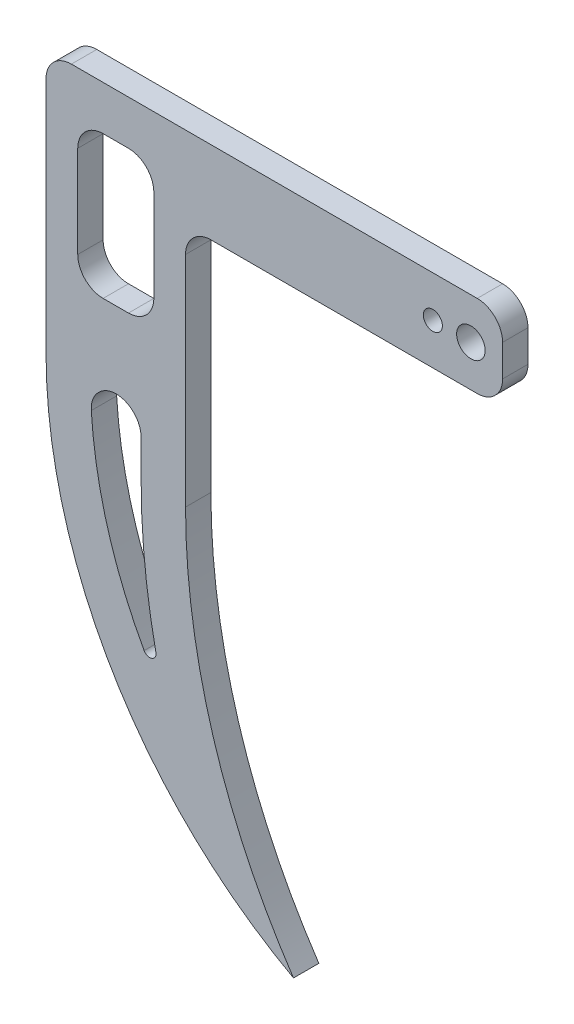
ISO-10303-21;
HEADER;
FILE_DESCRIPTION(('STEP AP214'),'2;1');
FILE_NAME('part.step','',(''),(''),'','','');
FILE_SCHEMA(('AUTOMOTIVE_DESIGN { 1 0 10303 214 1 1 1 1 }'));
ENDSEC;
DATA;
#1=APPLICATION_CONTEXT('core data for automotive mechanical design processes');
#2=APPLICATION_PROTOCOL_DEFINITION('international standard','automotive_design',2000,#1);
#3=PRODUCT_CONTEXT('',#1,'mechanical');
#4=PRODUCT('Part','Part','',(#3));
#5=PRODUCT_RELATED_PRODUCT_CATEGORY('part','',(#4));
#6=PRODUCT_DEFINITION_FORMATION('','',#4);
#7=PRODUCT_DEFINITION_CONTEXT('part definition',#1,'design');
#8=PRODUCT_DEFINITION('design','',#6,#7);
#9=PRODUCT_DEFINITION_SHAPE('','',#8);
#10=(LENGTH_UNIT() NAMED_UNIT(*) SI_UNIT(.MILLI.,.METRE.));
#11=(NAMED_UNIT(*) PLANE_ANGLE_UNIT() SI_UNIT($,.RADIAN.));
#12=(NAMED_UNIT(*) SI_UNIT($,.STERADIAN.) SOLID_ANGLE_UNIT());
#13=UNCERTAINTY_MEASURE_WITH_UNIT(LENGTH_MEASURE(1.E-05),#10,'distance_accuracy_value','');
#14=(GEOMETRIC_REPRESENTATION_CONTEXT(3) GLOBAL_UNCERTAINTY_ASSIGNED_CONTEXT((#13)) GLOBAL_UNIT_ASSIGNED_CONTEXT((#10,
#11,#12)) REPRESENTATION_CONTEXT('',''));
#15=CARTESIAN_POINT('',(0.,0.,0.));
#16=DIRECTION('',(0.,0.,1.));
#17=DIRECTION('',(1.,0.,0.));
#18=AXIS2_PLACEMENT_3D('',#15,#16,#17);
#19=CARTESIAN_POINT('',(64.,-23.25,4.));
#20=DIRECTION('',(0.,0.,1.));
#21=DIRECTION('',(1.,0.,0.));
#22=AXIS2_PLACEMENT_3D('',#19,#20,#21);
#23=PLANE('',#22);
#24=CARTESIAN_POINT('',(50.,11.75,4.));
#25=DIRECTION('',(0.,0.,1.));
#26=DIRECTION('',(1.,0.,0.));
#27=AXIS2_PLACEMENT_3D('',#24,#25,#26);
#28=CIRCLE('',#27,1.5);
#29=CARTESIAN_POINT('',(51.5,11.75,4.));
#30=VERTEX_POINT('',#29);
#31=EDGE_CURVE('E381',#30,#30,#28,.T.);
#32=ORIENTED_EDGE('',*,*,#31,.F.);
#33=EDGE_LOOP('',(#32));
#34=FACE_BOUND('',#33,.T.);
#35=CARTESIAN_POINT('',(56.,11.75,4.));
#36=DIRECTION('',(0.,0.,1.));
#37=DIRECTION('',(1.,0.,0.));
#38=AXIS2_PLACEMENT_3D('',#35,#36,#37);
#39=CIRCLE('',#38,2.25);
#40=CARTESIAN_POINT('',(58.25,11.75,4.));
#41=VERTEX_POINT('',#40);
#42=EDGE_CURVE('E535',#41,#41,#39,.T.);
#43=ORIENTED_EDGE('',*,*,#42,.F.);
#44=EDGE_LOOP('',(#43));
#45=FACE_BOUND('',#44,.T.);
#46=DIRECTION('',(0.,1.,0.));
#47=VECTOR('',#46,1.);
#48=CARTESIAN_POINT('',(4.,-23.25,4.));
#49=LINE('',#48,#47);
#50=CARTESIAN_POINT('',(4.,-33.25,4.));
#51=VERTEX_POINT('',#50);
#52=CARTESIAN_POINT('',(4.,-27.25,4.));
#53=VERTEX_POINT('',#52);
#54=EDGE_CURVE('E233',#51,#53,#49,.T.);
#55=ORIENTED_EDGE('',*,*,#54,.F.);
#56=CARTESIAN_POINT('',(111.,-33.25,4.));
#57=DIRECTION('',(0.,0.,-1.));
#58=DIRECTION('',(1.,0.,0.));
#59=AXIS2_PLACEMENT_3D('',#56,#57,#58);
#60=CIRCLE('',#59,107.);
#61=CARTESIAN_POINT('',(6.32276142221805,-55.4237620563159,4.));
#62=VERTEX_POINT('',#61);
#63=EDGE_CURVE('E215',#62,#51,#60,.T.);
#64=ORIENTED_EDGE('',*,*,#63,.F.);
#65=CARTESIAN_POINT('',(5.34446947289298,-55.630993477403,4.));
#66=DIRECTION('',(0.,0.,1.));
#67=DIRECTION('',(1.,0.,0.));
#68=AXIS2_PLACEMENT_3D('',#65,#66,#67);
#69=CIRCLE('',#68,1.);
#70=CARTESIAN_POINT('',(4.46901379338393,-56.1142918875135,4.));
#71=VERTEX_POINT('',#70);
#72=EDGE_CURVE('E41',#62,#71,#69,.F.);
#73=ORIENTED_EDGE('',*,*,#72,.T.);
#74=CARTESIAN_POINT('',(64.,-23.25,4.));
#75=DIRECTION('',(0.,0.,1.));
#76=DIRECTION('',(1.,0.,0.));
#77=AXIS2_PLACEMENT_3D('',#74,#75,#76);
#78=CIRCLE('',#77,68.);
#79=CARTESIAN_POINT('',(-3.86705754635307,-27.5,4.));
#80=VERTEX_POINT('',#79);
#81=EDGE_CURVE('E227',#80,#71,#78,.T.);
#82=ORIENTED_EDGE('',*,*,#81,.F.);
#83=CARTESIAN_POINT('',(0.125122309314774,-27.25,4.));
#84=DIRECTION('',(0.,0.,1.));
#85=DIRECTION('',(1.,0.,0.));
#86=AXIS2_PLACEMENT_3D('',#83,#84,#85);
#87=CIRCLE('',#86,4.);
#88=CARTESIAN_POINT('',(0.0625611546573881,-23.2504892671818,4.));
#89=VERTEX_POINT('',#88);
#90=EDGE_CURVE('E357',#80,#89,#87,.F.);
#91=ORIENTED_EDGE('',*,*,#90,.T.);
#92=CARTESIAN_POINT('',(0.,-27.25,4.));
#93=DIRECTION('',(0.,0.,1.));
#94=DIRECTION('',(1.,0.,0.));
#95=AXIS2_PLACEMENT_3D('',#92,#93,#94);
#96=CIRCLE('',#95,4.);
#97=EDGE_CURVE('E353',#89,#53,#96,.F.);
#98=ORIENTED_EDGE('',*,*,#97,.T.);
#99=EDGE_LOOP('',(#55,#64,#73,#82,#91,#98));
#100=FACE_BOUND('',#99,.T.);
#101=DIRECTION('',(-1.,0.,0.));
#102=VECTOR('',#101,1.);
#103=CARTESIAN_POINT('',(-11.,18.25,4.));
#104=LINE('',#103,#102);
#105=CARTESIAN_POINT('',(57.,18.25,4.));
#106=VERTEX_POINT('',#105);
#107=CARTESIAN_POINT('',(-7.00000000000001,18.25,4.));
#108=VERTEX_POINT('',#107);
#109=EDGE_CURVE('E264',#106,#108,#104,.T.);
#110=ORIENTED_EDGE('',*,*,#109,.T.);
#111=CARTESIAN_POINT('',(-7.00000000000001,14.25,4.));
#112=DIRECTION('',(0.,0.,1.));
#113=DIRECTION('',(1.,0.,0.));
#114=AXIS2_PLACEMENT_3D('',#111,#112,#113);
#115=CIRCLE('',#114,4.);
#116=CARTESIAN_POINT('',(-11.,14.25,4.));
#117=VERTEX_POINT('',#116);
#118=EDGE_CURVE('E319',#108,#117,#115,.T.);
#119=ORIENTED_EDGE('',*,*,#118,.T.);
#120=DIRECTION('',(0.,-1.,0.));
#121=VECTOR('',#120,1.);
#122=CARTESIAN_POINT('',(-11.,-18.25,4.));
#123=LINE('',#122,#121);
#124=CARTESIAN_POINT('',(-11.,-23.25,4.));
#125=VERTEX_POINT('',#124);
#126=EDGE_CURVE('E268',#117,#125,#123,.T.);
#127=ORIENTED_EDGE('',*,*,#126,.T.);
#128=CARTESIAN_POINT('',(64.,-23.25,4.));
#129=DIRECTION('',(0.,0.,1.));
#130=DIRECTION('',(1.,0.,0.));
#131=AXIS2_PLACEMENT_3D('',#128,#129,#130);
#132=CIRCLE('',#131,75.);
#133=CARTESIAN_POINT('',(28.0199855706445,-89.0560678179708,4.));
#134=VERTEX_POINT('',#133);
#135=EDGE_CURVE('E270',#125,#134,#132,.T.);
#136=ORIENTED_EDGE('',*,*,#135,.T.);
#137=CARTESIAN_POINT('',(111.,-33.25,4.));
#138=DIRECTION('',(0.,0.,-1.));
#139=DIRECTION('',(1.,0.,0.));
#140=AXIS2_PLACEMENT_3D('',#137,#138,#139);
#141=CIRCLE('',#140,100.);
#142=CARTESIAN_POINT('',(11.,-33.25,4.));
#143=VERTEX_POINT('',#142);
#144=EDGE_CURVE('E272',#134,#143,#141,.T.);
#145=ORIENTED_EDGE('',*,*,#144,.T.);
#146=DIRECTION('',(0.,1.,0.));
#147=VECTOR('',#146,1.);
#148=CARTESIAN_POINT('',(11.,-18.25,4.));
#149=LINE('',#148,#147);
#150=CARTESIAN_POINT('',(11.,1.25,4.));
#151=VERTEX_POINT('',#150);
#152=EDGE_CURVE('E261',#143,#151,#149,.T.);
#153=ORIENTED_EDGE('',*,*,#152,.T.);
#154=CARTESIAN_POINT('',(15.,1.25,4.));
#155=DIRECTION('',(0.,0.,1.));
#156=DIRECTION('',(1.,0.,0.));
#157=AXIS2_PLACEMENT_3D('',#154,#155,#156);
#158=CIRCLE('',#157,4.);
#159=CARTESIAN_POINT('',(15.,5.25,4.));
#160=VERTEX_POINT('',#159);
#161=EDGE_CURVE('E349',#151,#160,#158,.F.);
#162=ORIENTED_EDGE('',*,*,#161,.T.);
#163=DIRECTION('',(1.,0.,0.));
#164=VECTOR('',#163,1.);
#165=CARTESIAN_POINT('',(61.,5.25000000000001,4.));
#166=LINE('',#165,#164);
#167=CARTESIAN_POINT('',(57.,5.25000000000001,4.));
#168=VERTEX_POINT('',#167);
#169=EDGE_CURVE('E543',#160,#168,#166,.T.);
#170=ORIENTED_EDGE('',*,*,#169,.T.);
#171=CARTESIAN_POINT('',(57.,9.25000000000001,4.));
#172=DIRECTION('',(0.,0.,1.));
#173=DIRECTION('',(1.,0.,0.));
#174=AXIS2_PLACEMENT_3D('',#171,#172,#173);
#175=CIRCLE('',#174,4.);
#176=CARTESIAN_POINT('',(61.,9.25000000000001,4.));
#177=VERTEX_POINT('',#176);
#178=EDGE_CURVE('E317',#168,#177,#175,.T.);
#179=ORIENTED_EDGE('',*,*,#178,.T.);
#180=DIRECTION('',(0.,1.,0.));
#181=VECTOR('',#180,1.);
#182=CARTESIAN_POINT('',(61.,18.25,4.));
#183=LINE('',#182,#181);
#184=CARTESIAN_POINT('',(61.,14.25,4.));
#185=VERTEX_POINT('',#184);
#186=EDGE_CURVE('E230',#177,#185,#183,.T.);
#187=ORIENTED_EDGE('',*,*,#186,.T.);
#188=CARTESIAN_POINT('',(57.,14.25,4.));
#189=DIRECTION('',(0.,0.,1.));
#190=DIRECTION('',(1.,0.,0.));
#191=AXIS2_PLACEMENT_3D('',#188,#189,#190);
#192=CIRCLE('',#191,4.);
#193=EDGE_CURVE('E315',#185,#106,#192,.T.);
#194=ORIENTED_EDGE('',*,*,#193,.T.);
#195=EDGE_LOOP('',(#110,#119,#127,#136,#145,#153,#162,#170,#179,#187,#194));
#196=FACE_BOUND('',#195,.T.);
#197=DIRECTION('',(-1.,0.,0.));
#198=VECTOR('',#197,1.);
#199=CARTESIAN_POINT('',(-6.,11.25,4.));
#200=LINE('',#199,#198);
#201=CARTESIAN_POINT('',(2.,11.25,4.));
#202=VERTEX_POINT('',#201);
#203=CARTESIAN_POINT('',(-2.,11.25,4.));
#204=VERTEX_POINT('',#203);
#205=EDGE_CURVE('E240',#202,#204,#200,.T.);
#206=ORIENTED_EDGE('',*,*,#205,.F.);
#207=CARTESIAN_POINT('',(2.,7.25,4.));
#208=DIRECTION('',(0.,0.,1.));
#209=DIRECTION('',(1.,0.,0.));
#210=AXIS2_PLACEMENT_3D('',#207,#208,#209);
#211=CIRCLE('',#210,4.);
#212=CARTESIAN_POINT('',(6.,7.24999999999999,4.));
#213=VERTEX_POINT('',#212);
#214=EDGE_CURVE('E371',#202,#213,#211,.F.);
#215=ORIENTED_EDGE('',*,*,#214,.T.);
#216=DIRECTION('',(0.,1.,0.));
#217=VECTOR('',#216,1.);
#218=CARTESIAN_POINT('',(6.,-11.25,4.));
#219=LINE('',#218,#217);
#220=CARTESIAN_POINT('',(6.,-7.25,4.));
#221=VERTEX_POINT('',#220);
#222=EDGE_CURVE('E237',#221,#213,#219,.T.);
#223=ORIENTED_EDGE('',*,*,#222,.F.);
#224=CARTESIAN_POINT('',(2.,-7.25,4.));
#225=DIRECTION('',(0.,0.,1.));
#226=DIRECTION('',(1.,0.,0.));
#227=AXIS2_PLACEMENT_3D('',#224,#225,#226);
#228=CIRCLE('',#227,4.);
#229=CARTESIAN_POINT('',(2.,-11.25,4.));
#230=VERTEX_POINT('',#229);
#231=EDGE_CURVE('E363',#221,#230,#228,.F.);
#232=ORIENTED_EDGE('',*,*,#231,.T.);
#233=DIRECTION('',(1.,0.,0.));
#234=VECTOR('',#233,1.);
#235=CARTESIAN_POINT('',(-6.,-11.25,4.));
#236=LINE('',#235,#234);
#237=CARTESIAN_POINT('',(-2.,-11.25,4.));
#238=VERTEX_POINT('',#237);
#239=EDGE_CURVE('E247',#238,#230,#236,.T.);
#240=ORIENTED_EDGE('',*,*,#239,.F.);
#241=CARTESIAN_POINT('',(-2.,-7.25,4.));
#242=DIRECTION('',(0.,0.,1.));
#243=DIRECTION('',(1.,0.,0.));
#244=AXIS2_PLACEMENT_3D('',#241,#242,#243);
#245=CIRCLE('',#244,4.);
#246=CARTESIAN_POINT('',(-6.,-7.25,4.));
#247=VERTEX_POINT('',#246);
#248=EDGE_CURVE('E367',#238,#247,#245,.F.);
#249=ORIENTED_EDGE('',*,*,#248,.T.);
#250=DIRECTION('',(0.,-1.,0.));
#251=VECTOR('',#250,1.);
#252=CARTESIAN_POINT('',(-6.,-11.25,4.));
#253=LINE('',#252,#251);
#254=CARTESIAN_POINT('',(-6.,7.24999999999999,4.));
#255=VERTEX_POINT('',#254);
#256=EDGE_CURVE('E244',#255,#247,#253,.T.);
#257=ORIENTED_EDGE('',*,*,#256,.F.);
#258=CARTESIAN_POINT('',(-2.,7.25,4.));
#259=DIRECTION('',(0.,0.,1.));
#260=DIRECTION('',(1.,0.,0.));
#261=AXIS2_PLACEMENT_3D('',#258,#259,#260);
#262=CIRCLE('',#261,4.);
#263=EDGE_CURVE('E375',#255,#204,#262,.F.);
#264=ORIENTED_EDGE('',*,*,#263,.T.);
#265=EDGE_LOOP('',(#206,#215,#223,#232,#240,#249,#257,#264));
#266=FACE_BOUND('',#265,.T.);
#267=ADVANCED_FACE('F33',(#34,#45,#100,#196,#266),#23,.T.);
#268=CARTESIAN_POINT('',(64.,-23.25,0.));
#269=DIRECTION('',(0.,0.,1.));
#270=DIRECTION('',(1.,0.,0.));
#271=AXIS2_PLACEMENT_3D('',#268,#269,#270);
#272=PLANE('',#271);
#273=CARTESIAN_POINT('',(50.,11.75,0.));
#274=DIRECTION('',(0.,0.,1.));
#275=DIRECTION('',(1.,0.,0.));
#276=AXIS2_PLACEMENT_3D('',#273,#274,#275);
#277=CIRCLE('',#276,1.5);
#278=CARTESIAN_POINT('',(51.5,11.75,0.));
#279=VERTEX_POINT('',#278);
#280=EDGE_CURVE('E532',#279,#279,#277,.F.);
#281=ORIENTED_EDGE('',*,*,#280,.F.);
#282=EDGE_LOOP('',(#281));
#283=FACE_BOUND('',#282,.T.);
#284=CARTESIAN_POINT('',(56.,11.75,0.));
#285=DIRECTION('',(0.,0.,1.));
#286=DIRECTION('',(1.,0.,0.));
#287=AXIS2_PLACEMENT_3D('',#284,#285,#286);
#288=CIRCLE('',#287,2.25);
#289=CARTESIAN_POINT('',(58.25,11.75,0.));
#290=VERTEX_POINT('',#289);
#291=EDGE_CURVE('E540',#290,#290,#288,.F.);
#292=ORIENTED_EDGE('',*,*,#291,.F.);
#293=EDGE_LOOP('',(#292));
#294=FACE_BOUND('',#293,.T.);
#295=CARTESIAN_POINT('',(64.,-23.25,0.));
#296=DIRECTION('',(0.,0.,1.));
#297=DIRECTION('',(1.,0.,0.));
#298=AXIS2_PLACEMENT_3D('',#295,#296,#297);
#299=CIRCLE('',#298,68.);
#300=CARTESIAN_POINT('',(-3.86705754635307,-27.5,0.));
#301=VERTEX_POINT('',#300);
#302=CARTESIAN_POINT('',(4.46901379338393,-56.1142918875135,0.));
#303=VERTEX_POINT('',#302);
#304=EDGE_CURVE('E211',#301,#303,#299,.T.);
#305=ORIENTED_EDGE('',*,*,#304,.T.);
#306=CARTESIAN_POINT('',(5.34446947289298,-55.630993477403,0.));
#307=DIRECTION('',(0.,0.,1.));
#308=DIRECTION('',(1.,0.,0.));
#309=AXIS2_PLACEMENT_3D('',#306,#307,#308);
#310=CIRCLE('',#309,1.);
#311=CARTESIAN_POINT('',(6.32276142221805,-55.4237620563159,0.));
#312=VERTEX_POINT('',#311);
#313=EDGE_CURVE('E11',#303,#312,#310,.T.);
#314=ORIENTED_EDGE('',*,*,#313,.T.);
#315=CARTESIAN_POINT('',(111.,-33.25,0.));
#316=DIRECTION('',(0.,0.,-1.));
#317=DIRECTION('',(1.,0.,0.));
#318=AXIS2_PLACEMENT_3D('',#315,#316,#317);
#319=CIRCLE('',#318,107.);
#320=CARTESIAN_POINT('',(4.,-33.25,0.));
#321=VERTEX_POINT('',#320);
#322=EDGE_CURVE('E200',#312,#321,#319,.T.);
#323=ORIENTED_EDGE('',*,*,#322,.T.);
#324=DIRECTION('',(0.,1.,0.));
#325=VECTOR('',#324,1.);
#326=CARTESIAN_POINT('',(4.,-23.25,0.));
#327=LINE('',#326,#325);
#328=CARTESIAN_POINT('',(4.,-27.25,0.));
#329=VERTEX_POINT('',#328);
#330=EDGE_CURVE('E205',#321,#329,#327,.T.);
#331=ORIENTED_EDGE('',*,*,#330,.T.);
#332=CARTESIAN_POINT('',(0.,-27.25,0.));
#333=DIRECTION('',(0.,0.,1.));
#334=DIRECTION('',(1.,0.,0.));
#335=AXIS2_PLACEMENT_3D('',#332,#333,#334);
#336=CIRCLE('',#335,4.);
#337=CARTESIAN_POINT('',(0.0625611546573881,-23.2504892671818,0.));
#338=VERTEX_POINT('',#337);
#339=EDGE_CURVE('E355',#329,#338,#336,.T.);
#340=ORIENTED_EDGE('',*,*,#339,.T.);
#341=CARTESIAN_POINT('',(0.125122309314774,-27.25,0.));
#342=DIRECTION('',(0.,0.,1.));
#343=DIRECTION('',(1.,0.,0.));
#344=AXIS2_PLACEMENT_3D('',#341,#342,#343);
#345=CIRCLE('',#344,4.);
#346=EDGE_CURVE('E359',#338,#301,#345,.T.);
#347=ORIENTED_EDGE('',*,*,#346,.T.);
#348=EDGE_LOOP('',(#305,#314,#323,#331,#340,#347));
#349=FACE_BOUND('',#348,.T.);
#350=DIRECTION('',(0.,-1.,0.));
#351=VECTOR('',#350,1.);
#352=CARTESIAN_POINT('',(-11.,-18.25,0.));
#353=LINE('',#352,#351);
#354=CARTESIAN_POINT('',(-11.,14.25,0.));
#355=VERTEX_POINT('',#354);
#356=CARTESIAN_POINT('',(-11.,-23.25,0.));
#357=VERTEX_POINT('',#356);
#358=EDGE_CURVE('E278',#355,#357,#353,.T.);
#359=ORIENTED_EDGE('',*,*,#358,.F.);
#360=CARTESIAN_POINT('',(-7.00000000000001,14.25,0.));
#361=DIRECTION('',(0.,0.,1.));
#362=DIRECTION('',(1.,0.,0.));
#363=AXIS2_PLACEMENT_3D('',#360,#361,#362);
#364=CIRCLE('',#363,4.);
#365=CARTESIAN_POINT('',(-7.00000000000001,18.25,0.));
#366=VERTEX_POINT('',#365);
#367=EDGE_CURVE('E309',#355,#366,#364,.F.);
#368=ORIENTED_EDGE('',*,*,#367,.T.);
#369=DIRECTION('',(-1.,0.,0.));
#370=VECTOR('',#369,1.);
#371=CARTESIAN_POINT('',(-11.,18.25,0.));
#372=LINE('',#371,#370);
#373=CARTESIAN_POINT('',(57.,18.25,0.));
#374=VERTEX_POINT('',#373);
#375=EDGE_CURVE('E250',#374,#366,#372,.T.);
#376=ORIENTED_EDGE('',*,*,#375,.F.);
#377=CARTESIAN_POINT('',(57.,14.25,0.));
#378=DIRECTION('',(0.,0.,1.));
#379=DIRECTION('',(1.,0.,0.));
#380=AXIS2_PLACEMENT_3D('',#377,#378,#379);
#381=CIRCLE('',#380,4.);
#382=CARTESIAN_POINT('',(61.,14.25,0.));
#383=VERTEX_POINT('',#382);
#384=EDGE_CURVE('E305',#374,#383,#381,.F.);
#385=ORIENTED_EDGE('',*,*,#384,.T.);
#386=DIRECTION('',(0.,1.,0.));
#387=VECTOR('',#386,1.);
#388=CARTESIAN_POINT('',(61.,18.25,0.));
#389=LINE('',#388,#387);
#390=CARTESIAN_POINT('',(61.,9.25000000000001,0.));
#391=VERTEX_POINT('',#390);
#392=EDGE_CURVE('E235',#391,#383,#389,.T.);
#393=ORIENTED_EDGE('',*,*,#392,.F.);
#394=CARTESIAN_POINT('',(57.,9.25000000000001,0.));
#395=DIRECTION('',(0.,0.,1.));
#396=DIRECTION('',(1.,0.,0.));
#397=AXIS2_PLACEMENT_3D('',#394,#395,#396);
#398=CIRCLE('',#397,4.);
#399=CARTESIAN_POINT('',(57.,5.25000000000001,0.));
#400=VERTEX_POINT('',#399);
#401=EDGE_CURVE('E307',#391,#400,#398,.F.);
#402=ORIENTED_EDGE('',*,*,#401,.T.);
#403=DIRECTION('',(1.,0.,0.));
#404=VECTOR('',#403,1.);
#405=CARTESIAN_POINT('',(61.,5.25000000000001,0.));
#406=LINE('',#405,#404);
#407=CARTESIAN_POINT('',(15.,5.25,0.));
#408=VERTEX_POINT('',#407);
#409=EDGE_CURVE('E544',#408,#400,#406,.T.);
#410=ORIENTED_EDGE('',*,*,#409,.F.);
#411=CARTESIAN_POINT('',(15.,1.25,0.));
#412=DIRECTION('',(0.,0.,1.));
#413=DIRECTION('',(1.,0.,0.));
#414=AXIS2_PLACEMENT_3D('',#411,#412,#413);
#415=CIRCLE('',#414,4.);
#416=CARTESIAN_POINT('',(11.,1.25,0.));
#417=VERTEX_POINT('',#416);
#418=EDGE_CURVE('E351',#408,#417,#415,.T.);
#419=ORIENTED_EDGE('',*,*,#418,.T.);
#420=DIRECTION('',(0.,1.,0.));
#421=VECTOR('',#420,1.);
#422=CARTESIAN_POINT('',(11.,-18.25,0.));
#423=LINE('',#422,#421);
#424=CARTESIAN_POINT('',(11.,-33.25,0.));
#425=VERTEX_POINT('',#424);
#426=EDGE_CURVE('E265',#425,#417,#423,.T.);
#427=ORIENTED_EDGE('',*,*,#426,.F.);
#428=CARTESIAN_POINT('',(111.,-33.25,0.));
#429=DIRECTION('',(0.,0.,-1.));
#430=DIRECTION('',(1.,0.,0.));
#431=AXIS2_PLACEMENT_3D('',#428,#429,#430);
#432=CIRCLE('',#431,100.);
#433=CARTESIAN_POINT('',(28.0199855706445,-89.0560678179708,0.));
#434=VERTEX_POINT('',#433);
#435=EDGE_CURVE('E282',#434,#425,#432,.T.);
#436=ORIENTED_EDGE('',*,*,#435,.F.);
#437=CARTESIAN_POINT('',(64.,-23.25,0.));
#438=DIRECTION('',(0.,0.,1.));
#439=DIRECTION('',(1.,0.,0.));
#440=AXIS2_PLACEMENT_3D('',#437,#438,#439);
#441=CIRCLE('',#440,75.);
#442=EDGE_CURVE('E280',#357,#434,#441,.T.);
#443=ORIENTED_EDGE('',*,*,#442,.F.);
#444=EDGE_LOOP('',(#359,#368,#376,#385,#393,#402,#410,#419,#427,#436,#443));
#445=FACE_BOUND('',#444,.T.);
#446=DIRECTION('',(1.,0.,0.));
#447=VECTOR('',#446,1.);
#448=CARTESIAN_POINT('',(-6.,-11.25,0.));
#449=LINE('',#448,#447);
#450=CARTESIAN_POINT('',(-2.,-11.25,0.));
#451=VERTEX_POINT('',#450);
#452=CARTESIAN_POINT('',(2.,-11.25,0.));
#453=VERTEX_POINT('',#452);
#454=EDGE_CURVE('E241',#451,#453,#449,.T.);
#455=ORIENTED_EDGE('',*,*,#454,.T.);
#456=CARTESIAN_POINT('',(2.,-7.25,0.));
#457=DIRECTION('',(0.,0.,1.));
#458=DIRECTION('',(1.,0.,0.));
#459=AXIS2_PLACEMENT_3D('',#456,#457,#458);
#460=CIRCLE('',#459,4.);
#461=CARTESIAN_POINT('',(6.,-7.25,0.));
#462=VERTEX_POINT('',#461);
#463=EDGE_CURVE('E361',#453,#462,#460,.T.);
#464=ORIENTED_EDGE('',*,*,#463,.T.);
#465=DIRECTION('',(0.,1.,0.));
#466=VECTOR('',#465,1.);
#467=CARTESIAN_POINT('',(6.,-11.25,0.));
#468=LINE('',#467,#466);
#469=CARTESIAN_POINT('',(6.,7.24999999999999,0.));
#470=VERTEX_POINT('',#469);
#471=EDGE_CURVE('E219',#462,#470,#468,.T.);
#472=ORIENTED_EDGE('',*,*,#471,.T.);
#473=CARTESIAN_POINT('',(2.,7.25,0.));
#474=DIRECTION('',(0.,0.,1.));
#475=DIRECTION('',(1.,0.,0.));
#476=AXIS2_PLACEMENT_3D('',#473,#474,#475);
#477=CIRCLE('',#476,4.);
#478=CARTESIAN_POINT('',(2.,11.25,0.));
#479=VERTEX_POINT('',#478);
#480=EDGE_CURVE('E369',#470,#479,#477,.T.);
#481=ORIENTED_EDGE('',*,*,#480,.T.);
#482=DIRECTION('',(-1.,0.,0.));
#483=VECTOR('',#482,1.);
#484=CARTESIAN_POINT('',(-6.,11.25,0.));
#485=LINE('',#484,#483);
#486=CARTESIAN_POINT('',(-2.,11.25,0.));
#487=VERTEX_POINT('',#486);
#488=EDGE_CURVE('E253',#479,#487,#485,.T.);
#489=ORIENTED_EDGE('',*,*,#488,.T.);
#490=CARTESIAN_POINT('',(-2.,7.25,0.));
#491=DIRECTION('',(0.,0.,1.));
#492=DIRECTION('',(1.,0.,0.));
#493=AXIS2_PLACEMENT_3D('',#490,#491,#492);
#494=CIRCLE('',#493,4.);
#495=CARTESIAN_POINT('',(-6.,7.24999999999999,0.));
#496=VERTEX_POINT('',#495);
#497=EDGE_CURVE('E373',#487,#496,#494,.T.);
#498=ORIENTED_EDGE('',*,*,#497,.T.);
#499=DIRECTION('',(0.,-1.,0.));
#500=VECTOR('',#499,1.);
#501=CARTESIAN_POINT('',(-6.,-11.25,0.));
#502=LINE('',#501,#500);
#503=CARTESIAN_POINT('',(-6.,-7.25,0.));
#504=VERTEX_POINT('',#503);
#505=EDGE_CURVE('E256',#496,#504,#502,.T.);
#506=ORIENTED_EDGE('',*,*,#505,.T.);
#507=CARTESIAN_POINT('',(-2.,-7.25,0.));
#508=DIRECTION('',(0.,0.,1.));
#509=DIRECTION('',(1.,0.,0.));
#510=AXIS2_PLACEMENT_3D('',#507,#508,#509);
#511=CIRCLE('',#510,4.);
#512=EDGE_CURVE('E365',#504,#451,#511,.T.);
#513=ORIENTED_EDGE('',*,*,#512,.T.);
#514=EDGE_LOOP('',(#455,#464,#472,#481,#489,#498,#506,#513));
#515=FACE_BOUND('',#514,.T.);
#516=ADVANCED_FACE('F202',(#283,#294,#349,#445,#515),#272,.F.);
#517=CARTESIAN_POINT('',(-11.,18.25,4.));
#518=DIRECTION('',(0.,-1.,0.));
#519=DIRECTION('',(0.,0.,-1.));
#520=AXIS2_PLACEMENT_3D('',#517,#518,#519);
#521=PLANE('',#520);
#522=ORIENTED_EDGE('',*,*,#375,.T.);
#523=DIRECTION('',(0.,0.,-1.));
#524=VECTOR('',#523,1.);
#525=CARTESIAN_POINT('',(-7.00000000000001,18.25,4.));
#526=LINE('',#525,#524);
#527=EDGE_CURVE('E313',#366,#108,#526,.F.);
#528=ORIENTED_EDGE('',*,*,#527,.T.);
#529=ORIENTED_EDGE('',*,*,#109,.F.);
#530=DIRECTION('',(0.,0.,1.));
#531=VECTOR('',#530,1.);
#532=CARTESIAN_POINT('',(57.,18.25,0.));
#533=LINE('',#532,#531);
#534=EDGE_CURVE('E311',#106,#374,#533,.F.);
#535=ORIENTED_EDGE('',*,*,#534,.T.);
#536=EDGE_LOOP('',(#522,#528,#529,#535));
#537=FACE_BOUND('',#536,.T.);
#538=ADVANCED_FACE('F408',(#537),#521,.F.);
#539=CARTESIAN_POINT('',(-11.,-18.25,4.));
#540=DIRECTION('',(1.,0.,0.));
#541=DIRECTION('',(0.,1.,0.));
#542=AXIS2_PLACEMENT_3D('',#539,#540,#541);
#543=PLANE('',#542);
#544=ORIENTED_EDGE('',*,*,#126,.F.);
#545=DIRECTION('',(0.,0.,-1.));
#546=VECTOR('',#545,1.);
#547=CARTESIAN_POINT('',(-11.,14.25,4.));
#548=LINE('',#547,#546);
#549=EDGE_CURVE('E302',#117,#355,#548,.T.);
#550=ORIENTED_EDGE('',*,*,#549,.T.);
#551=ORIENTED_EDGE('',*,*,#358,.T.);
#552=DIRECTION('',(0.,0.,-1.));
#553=VECTOR('',#552,1.);
#554=CARTESIAN_POINT('',(-11.,-23.25,4.));
#555=LINE('',#554,#553);
#556=EDGE_CURVE('E291',#125,#357,#555,.T.);
#557=ORIENTED_EDGE('',*,*,#556,.F.);
#558=EDGE_LOOP('',(#544,#550,#551,#557));
#559=FACE_BOUND('',#558,.T.);
#560=ADVANCED_FACE('F428',(#559),#543,.F.);
#561=CARTESIAN_POINT('',(64.,-23.25,4.));
#562=DIRECTION('',(0.,0.,-1.));
#563=DIRECTION('',(-1.,0.,0.));
#564=AXIS2_PLACEMENT_3D('',#561,#562,#563);
#565=CYLINDRICAL_SURFACE('',#564,75.);
#566=ORIENTED_EDGE('',*,*,#442,.T.);
#567=DIRECTION('',(0.,0.,-1.));
#568=VECTOR('',#567,1.);
#569=CARTESIAN_POINT('',(28.0199855706445,-89.0560678179708,4.));
#570=LINE('',#569,#568);
#571=EDGE_CURVE('E288',#134,#434,#570,.T.);
#572=ORIENTED_EDGE('',*,*,#571,.F.);
#573=ORIENTED_EDGE('',*,*,#135,.F.);
#574=ORIENTED_EDGE('',*,*,#556,.T.);
#575=EDGE_LOOP('',(#566,#572,#573,#574));
#576=FACE_BOUND('',#575,.T.);
#577=ADVANCED_FACE('F424',(#576),#565,.T.);
#578=CARTESIAN_POINT('',(111.,-33.25,4.));
#579=DIRECTION('',(0.,0.,-1.));
#580=DIRECTION('',(-1.,0.,0.));
#581=AXIS2_PLACEMENT_3D('',#578,#579,#580);
#582=CYLINDRICAL_SURFACE('',#581,100.);
#583=ORIENTED_EDGE('',*,*,#435,.T.);
#584=DIRECTION('',(0.,0.,-1.));
#585=VECTOR('',#584,1.);
#586=CARTESIAN_POINT('',(11.,-33.25,4.));
#587=LINE('',#586,#585);
#588=EDGE_CURVE('E275',#143,#425,#587,.T.);
#589=ORIENTED_EDGE('',*,*,#588,.F.);
#590=ORIENTED_EDGE('',*,*,#144,.F.);
#591=ORIENTED_EDGE('',*,*,#571,.T.);
#592=EDGE_LOOP('',(#583,#589,#590,#591));
#593=FACE_BOUND('',#592,.T.);
#594=ADVANCED_FACE('F420',(#593),#582,.F.);
#595=CARTESIAN_POINT('',(11.,-18.25,4.));
#596=DIRECTION('',(-1.,0.,0.));
#597=DIRECTION('',(0.,0.,1.));
#598=AXIS2_PLACEMENT_3D('',#595,#596,#597);
#599=PLANE('',#598);
#600=ORIENTED_EDGE('',*,*,#426,.T.);
#601=DIRECTION('',(0.,0.,1.));
#602=VECTOR('',#601,1.);
#603=CARTESIAN_POINT('',(11.,1.25,4.));
#604=LINE('',#603,#602);
#605=EDGE_CURVE('E294',#417,#151,#604,.T.);
#606=ORIENTED_EDGE('',*,*,#605,.T.);
#607=ORIENTED_EDGE('',*,*,#152,.F.);
#608=ORIENTED_EDGE('',*,*,#588,.T.);
#609=EDGE_LOOP('',(#600,#606,#607,#608));
#610=FACE_BOUND('',#609,.T.);
#611=ADVANCED_FACE('F417',(#610),#599,.F.);
#612=CARTESIAN_POINT('',(6.,-11.25,4.));
#613=DIRECTION('',(-1.,0.,0.));
#614=DIRECTION('',(0.,0.,1.));
#615=AXIS2_PLACEMENT_3D('',#612,#613,#614);
#616=PLANE('',#615);
#617=ORIENTED_EDGE('',*,*,#471,.F.);
#618=DIRECTION('',(0.,0.,-1.));
#619=VECTOR('',#618,1.);
#620=CARTESIAN_POINT('',(6.,-7.25,4.));
#621=LINE('',#620,#619);
#622=EDGE_CURVE('E337',#462,#221,#621,.F.);
#623=ORIENTED_EDGE('',*,*,#622,.T.);
#624=ORIENTED_EDGE('',*,*,#222,.T.);
#625=DIRECTION('',(0.,0.,-1.));
#626=VECTOR('',#625,1.);
#627=CARTESIAN_POINT('',(6.,7.25,0.));
#628=LINE('',#627,#626);
#629=EDGE_CURVE('E334',#213,#470,#628,.T.);
#630=ORIENTED_EDGE('',*,*,#629,.T.);
#631=EDGE_LOOP('',(#617,#623,#624,#630));
#632=FACE_BOUND('',#631,.T.);
#633=ADVANCED_FACE('F414',(#632),#616,.T.);
#634=CARTESIAN_POINT('',(-6.,11.25,4.));
#635=DIRECTION('',(0.,-1.,0.));
#636=DIRECTION('',(0.,0.,-1.));
#637=AXIS2_PLACEMENT_3D('',#634,#635,#636);
#638=PLANE('',#637);
#639=ORIENTED_EDGE('',*,*,#488,.F.);
#640=DIRECTION('',(0.,0.,-1.));
#641=VECTOR('',#640,1.);
#642=CARTESIAN_POINT('',(2.,11.25,4.));
#643=LINE('',#642,#641);
#644=EDGE_CURVE('E347',#479,#202,#643,.F.);
#645=ORIENTED_EDGE('',*,*,#644,.T.);
#646=ORIENTED_EDGE('',*,*,#205,.T.);
#647=DIRECTION('',(0.,0.,-1.));
#648=VECTOR('',#647,1.);
#649=CARTESIAN_POINT('',(-2.,11.25,0.));
#650=LINE('',#649,#648);
#651=EDGE_CURVE('E344',#204,#487,#650,.T.);
#652=ORIENTED_EDGE('',*,*,#651,.T.);
#653=EDGE_LOOP('',(#639,#645,#646,#652));
#654=FACE_BOUND('',#653,.T.);
#655=ADVANCED_FACE('F496',(#654),#638,.T.);
#656=CARTESIAN_POINT('',(-6.,-11.25,4.));
#657=DIRECTION('',(1.,0.,0.));
#658=DIRECTION('',(0.,0.,-1.));
#659=AXIS2_PLACEMENT_3D('',#656,#657,#658);
#660=PLANE('',#659);
#661=ORIENTED_EDGE('',*,*,#256,.T.);
#662=DIRECTION('',(0.,0.,-1.));
#663=VECTOR('',#662,1.);
#664=CARTESIAN_POINT('',(-6.,-7.25,0.));
#665=LINE('',#664,#663);
#666=EDGE_CURVE('E341',#247,#504,#665,.T.);
#667=ORIENTED_EDGE('',*,*,#666,.T.);
#668=ORIENTED_EDGE('',*,*,#505,.F.);
#669=DIRECTION('',(0.,0.,-1.));
#670=VECTOR('',#669,1.);
#671=CARTESIAN_POINT('',(-6.,7.25,4.));
#672=LINE('',#671,#670);
#673=EDGE_CURVE('E339',#496,#255,#672,.F.);
#674=ORIENTED_EDGE('',*,*,#673,.T.);
#675=EDGE_LOOP('',(#661,#667,#668,#674));
#676=FACE_BOUND('',#675,.T.);
#677=ADVANCED_FACE('F490',(#676),#660,.T.);
#678=CARTESIAN_POINT('',(-6.,-11.25,4.));
#679=DIRECTION('',(0.,1.,0.));
#680=DIRECTION('',(0.,0.,1.));
#681=AXIS2_PLACEMENT_3D('',#678,#679,#680);
#682=PLANE('',#681);
#683=ORIENTED_EDGE('',*,*,#239,.T.);
#684=DIRECTION('',(0.,0.,-1.));
#685=VECTOR('',#684,1.);
#686=CARTESIAN_POINT('',(2.,-11.25,0.));
#687=LINE('',#686,#685);
#688=EDGE_CURVE('E331',#230,#453,#687,.T.);
#689=ORIENTED_EDGE('',*,*,#688,.T.);
#690=ORIENTED_EDGE('',*,*,#454,.F.);
#691=DIRECTION('',(0.,0.,-1.));
#692=VECTOR('',#691,1.);
#693=CARTESIAN_POINT('',(-2.,-11.25,4.));
#694=LINE('',#693,#692);
#695=EDGE_CURVE('E329',#451,#238,#694,.F.);
#696=ORIENTED_EDGE('',*,*,#695,.T.);
#697=EDGE_LOOP('',(#683,#689,#690,#696));
#698=FACE_BOUND('',#697,.T.);
#699=ADVANCED_FACE('F483',(#698),#682,.T.);
#700=CARTESIAN_POINT('',(4.,-23.25,0.));
#701=DIRECTION('',(1.,0.,0.));
#702=DIRECTION('',(0.,1.,0.));
#703=AXIS2_PLACEMENT_3D('',#700,#701,#702);
#704=PLANE('',#703);
#705=ORIENTED_EDGE('',*,*,#54,.T.);
#706=DIRECTION('',(0.,0.,1.));
#707=VECTOR('',#706,1.);
#708=CARTESIAN_POINT('',(4.,-27.25,0.));
#709=LINE('',#708,#707);
#710=EDGE_CURVE('E224',#53,#329,#709,.F.);
#711=ORIENTED_EDGE('',*,*,#710,.T.);
#712=ORIENTED_EDGE('',*,*,#330,.F.);
#713=DIRECTION('',(0.,0.,1.));
#714=VECTOR('',#713,1.);
#715=CARTESIAN_POINT('',(4.,-33.25,0.));
#716=LINE('',#715,#714);
#717=EDGE_CURVE('E210',#321,#51,#716,.T.);
#718=ORIENTED_EDGE('',*,*,#717,.T.);
#719=EDGE_LOOP('',(#705,#711,#712,#718));
#720=FACE_BOUND('',#719,.T.);
#721=ADVANCED_FACE('F222',(#720),#704,.F.);
#722=CARTESIAN_POINT('',(111.,-33.25,0.));
#723=DIRECTION('',(0.,0.,1.));
#724=DIRECTION('',(1.,0.,0.));
#725=AXIS2_PLACEMENT_3D('',#722,#723,#724);
#726=CYLINDRICAL_SURFACE('',#725,107.);
#727=ORIENTED_EDGE('',*,*,#322,.F.);
#728=DIRECTION('',(0.,0.,1.));
#729=VECTOR('',#728,1.);
#730=CARTESIAN_POINT('',(6.32276142221803,-55.4237620563159,0.));
#731=LINE('',#730,#729);
#732=EDGE_CURVE('E377',#312,#62,#731,.T.);
#733=ORIENTED_EDGE('',*,*,#732,.T.);
#734=ORIENTED_EDGE('',*,*,#63,.T.);
#735=ORIENTED_EDGE('',*,*,#717,.F.);
#736=EDGE_LOOP('',(#727,#733,#734,#735));
#737=FACE_BOUND('',#736,.T.);
#738=ADVANCED_FACE('F214',(#737),#726,.T.);
#739=CARTESIAN_POINT('',(64.,-23.25,0.));
#740=DIRECTION('',(0.,0.,1.));
#741=DIRECTION('',(1.,0.,0.));
#742=AXIS2_PLACEMENT_3D('',#739,#740,#741);
#743=CYLINDRICAL_SURFACE('',#742,68.);
#744=ORIENTED_EDGE('',*,*,#81,.T.);
#745=DIRECTION('',(0.,0.,1.));
#746=VECTOR('',#745,1.);
#747=CARTESIAN_POINT('',(4.46901379338393,-56.1142918875135,0.));
#748=LINE('',#747,#746);
#749=EDGE_CURVE('E54',#71,#303,#748,.F.);
#750=ORIENTED_EDGE('',*,*,#749,.T.);
#751=ORIENTED_EDGE('',*,*,#304,.F.);
#752=DIRECTION('',(0.,0.,1.));
#753=VECTOR('',#752,1.);
#754=CARTESIAN_POINT('',(-3.86705754635308,-27.5,0.));
#755=LINE('',#754,#753);
#756=EDGE_CURVE('E327',#301,#80,#755,.T.);
#757=ORIENTED_EDGE('',*,*,#756,.T.);
#758=EDGE_LOOP('',(#744,#750,#751,#757));
#759=FACE_BOUND('',#758,.T.);
#760=ADVANCED_FACE('F394',(#759),#743,.F.);
#761=CARTESIAN_POINT('',(61.,18.25,0.));
#762=DIRECTION('',(1.,0.,0.));
#763=DIRECTION('',(0.,0.,-1.));
#764=AXIS2_PLACEMENT_3D('',#761,#762,#763);
#765=PLANE('',#764);
#766=ORIENTED_EDGE('',*,*,#186,.F.);
#767=DIRECTION('',(0.,0.,1.));
#768=VECTOR('',#767,1.);
#769=CARTESIAN_POINT('',(61.,9.25000000000001,0.));
#770=LINE('',#769,#768);
#771=EDGE_CURVE('E324',#177,#391,#770,.F.);
#772=ORIENTED_EDGE('',*,*,#771,.T.);
#773=ORIENTED_EDGE('',*,*,#392,.T.);
#774=DIRECTION('',(0.,0.,1.));
#775=VECTOR('',#774,1.);
#776=CARTESIAN_POINT('',(61.,14.25,4.));
#777=LINE('',#776,#775);
#778=EDGE_CURVE('E321',#383,#185,#777,.T.);
#779=ORIENTED_EDGE('',*,*,#778,.T.);
#780=EDGE_LOOP('',(#766,#772,#773,#779));
#781=FACE_BOUND('',#780,.T.);
#782=ADVANCED_FACE('F511',(#781),#765,.T.);
#783=CARTESIAN_POINT('',(61.,5.25000000000001,0.));
#784=DIRECTION('',(0.,-1.,0.));
#785=DIRECTION('',(1.,0.,0.));
#786=AXIS2_PLACEMENT_3D('',#783,#784,#785);
#787=PLANE('',#786);
#788=ORIENTED_EDGE('',*,*,#169,.F.);
#789=DIRECTION('',(0.,0.,1.));
#790=VECTOR('',#789,1.);
#791=CARTESIAN_POINT('',(15.,5.25,0.));
#792=LINE('',#791,#790);
#793=EDGE_CURVE('E300',#160,#408,#792,.F.);
#794=ORIENTED_EDGE('',*,*,#793,.T.);
#795=ORIENTED_EDGE('',*,*,#409,.T.);
#796=DIRECTION('',(0.,0.,1.));
#797=VECTOR('',#796,1.);
#798=CARTESIAN_POINT('',(57.,5.25000000000001,0.));
#799=LINE('',#798,#797);
#800=EDGE_CURVE('E297',#400,#168,#799,.T.);
#801=ORIENTED_EDGE('',*,*,#800,.T.);
#802=EDGE_LOOP('',(#788,#794,#795,#801));
#803=FACE_BOUND('',#802,.T.);
#804=ADVANCED_FACE('F514',(#803),#787,.T.);
#805=CARTESIAN_POINT('',(56.,11.75,-6.36396103067893));
#806=DIRECTION('',(0.,0.,1.));
#807=DIRECTION('',(1.,0.,0.));
#808=AXIS2_PLACEMENT_3D('',#805,#806,#807);
#809=CYLINDRICAL_SURFACE('',#808,2.25);
#810=ORIENTED_EDGE('',*,*,#291,.T.);
#811=EDGE_LOOP('',(#810));
#812=FACE_BOUND('',#811,.T.);
#813=ORIENTED_EDGE('',*,*,#42,.T.);
#814=EDGE_LOOP('',(#813));
#815=FACE_BOUND('',#814,.T.);
#816=ADVANCED_FACE('F517',(#812,#815),#809,.F.);
#817=CARTESIAN_POINT('',(50.,11.75,-6.36396103067893));
#818=DIRECTION('',(0.,0.,1.));
#819=DIRECTION('',(1.,0.,0.));
#820=AXIS2_PLACEMENT_3D('',#817,#818,#819);
#821=CYLINDRICAL_SURFACE('',#820,1.5);
#822=ORIENTED_EDGE('',*,*,#280,.T.);
#823=EDGE_LOOP('',(#822));
#824=FACE_BOUND('',#823,.T.);
#825=ORIENTED_EDGE('',*,*,#31,.T.);
#826=EDGE_LOOP('',(#825));
#827=FACE_BOUND('',#826,.T.);
#828=ADVANCED_FACE('F440',(#824,#827),#821,.F.);
#829=CARTESIAN_POINT('',(15.,1.25,4.));
#830=DIRECTION('',(0.,0.,1.));
#831=DIRECTION('',(1.,0.,0.));
#832=AXIS2_PLACEMENT_3D('',#829,#830,#831);
#833=CYLINDRICAL_SURFACE('',#832,4.);
#834=ORIENTED_EDGE('',*,*,#418,.F.);
#835=ORIENTED_EDGE('',*,*,#793,.F.);
#836=ORIENTED_EDGE('',*,*,#161,.F.);
#837=ORIENTED_EDGE('',*,*,#605,.F.);
#838=EDGE_LOOP('',(#834,#835,#836,#837));
#839=FACE_BOUND('',#838,.T.);
#840=ADVANCED_FACE('F436',(#839),#833,.F.);
#841=CARTESIAN_POINT('',(-7.00000000000001,14.25,4.));
#842=DIRECTION('',(0.,0.,-1.));
#843=DIRECTION('',(-1.,0.,0.));
#844=AXIS2_PLACEMENT_3D('',#841,#842,#843);
#845=CYLINDRICAL_SURFACE('',#844,4.);
#846=ORIENTED_EDGE('',*,*,#118,.F.);
#847=ORIENTED_EDGE('',*,*,#527,.F.);
#848=ORIENTED_EDGE('',*,*,#367,.F.);
#849=ORIENTED_EDGE('',*,*,#549,.F.);
#850=EDGE_LOOP('',(#846,#847,#848,#849));
#851=FACE_BOUND('',#850,.T.);
#852=ADVANCED_FACE('F439',(#851),#845,.T.);
#853=CARTESIAN_POINT('',(57.,9.25000000000001,0.));
#854=DIRECTION('',(0.,0.,1.));
#855=DIRECTION('',(1.,0.,0.));
#856=AXIS2_PLACEMENT_3D('',#853,#854,#855);
#857=CYLINDRICAL_SURFACE('',#856,4.);
#858=ORIENTED_EDGE('',*,*,#401,.F.);
#859=ORIENTED_EDGE('',*,*,#771,.F.);
#860=ORIENTED_EDGE('',*,*,#178,.F.);
#861=ORIENTED_EDGE('',*,*,#800,.F.);
#862=EDGE_LOOP('',(#858,#859,#860,#861));
#863=FACE_BOUND('',#862,.T.);
#864=ADVANCED_FACE('F444',(#863),#857,.T.);
#865=CARTESIAN_POINT('',(57.,14.25,0.));
#866=DIRECTION('',(0.,0.,-1.));
#867=DIRECTION('',(-1.,0.,0.));
#868=AXIS2_PLACEMENT_3D('',#865,#866,#867);
#869=CYLINDRICAL_SURFACE('',#868,4.);
#870=ORIENTED_EDGE('',*,*,#384,.F.);
#871=ORIENTED_EDGE('',*,*,#534,.F.);
#872=ORIENTED_EDGE('',*,*,#193,.F.);
#873=ORIENTED_EDGE('',*,*,#778,.F.);
#874=EDGE_LOOP('',(#870,#871,#872,#873));
#875=FACE_BOUND('',#874,.T.);
#876=ADVANCED_FACE('F448',(#875),#869,.T.);
#877=CARTESIAN_POINT('',(0.125122309314774,-27.25,0.));
#878=DIRECTION('',(0.,0.,1.));
#879=DIRECTION('',(1.,0.,0.));
#880=AXIS2_PLACEMENT_3D('',#877,#878,#879);
#881=CYLINDRICAL_SURFACE('',#880,4.);
#882=ORIENTED_EDGE('',*,*,#756,.F.);
#883=ORIENTED_EDGE('',*,*,#346,.F.);
#884=DIRECTION('',(0.,0.,1.));
#885=VECTOR('',#884,1.);
#886=CARTESIAN_POINT('',(0.0625611546573881,-23.2504892671818,2.));
#887=LINE('',#886,#885);
#888=EDGE_CURVE('E378',#89,#338,#887,.F.);
#889=ORIENTED_EDGE('',*,*,#888,.F.);
#890=ORIENTED_EDGE('',*,*,#90,.F.);
#891=EDGE_LOOP('',(#882,#883,#889,#890));
#892=FACE_BOUND('',#891,.T.);
#893=ADVANCED_FACE('F392',(#892),#881,.F.);
#894=CARTESIAN_POINT('',(0.,-27.25,0.));
#895=DIRECTION('',(0.,0.,-1.));
#896=DIRECTION('',(-1.,0.,0.));
#897=AXIS2_PLACEMENT_3D('',#894,#895,#896);
#898=CYLINDRICAL_SURFACE('',#897,4.);
#899=ORIENTED_EDGE('',*,*,#339,.F.);
#900=ORIENTED_EDGE('',*,*,#710,.F.);
#901=ORIENTED_EDGE('',*,*,#97,.F.);
#902=ORIENTED_EDGE('',*,*,#888,.T.);
#903=EDGE_LOOP('',(#899,#900,#901,#902));
#904=FACE_BOUND('',#903,.T.);
#905=ADVANCED_FACE('F387',(#904),#898,.F.);
#906=CARTESIAN_POINT('',(2.,-7.25,4.));
#907=DIRECTION('',(0.,0.,1.));
#908=DIRECTION('',(1.,0.,0.));
#909=AXIS2_PLACEMENT_3D('',#906,#907,#908);
#910=CYLINDRICAL_SURFACE('',#909,4.);
#911=ORIENTED_EDGE('',*,*,#231,.F.);
#912=ORIENTED_EDGE('',*,*,#622,.F.);
#913=ORIENTED_EDGE('',*,*,#463,.F.);
#914=ORIENTED_EDGE('',*,*,#688,.F.);
#915=EDGE_LOOP('',(#911,#912,#913,#914));
#916=FACE_BOUND('',#915,.T.);
#917=ADVANCED_FACE('F455',(#916),#910,.F.);
#918=CARTESIAN_POINT('',(-2.,-7.25,4.));
#919=DIRECTION('',(0.,0.,1.));
#920=DIRECTION('',(1.,0.,0.));
#921=AXIS2_PLACEMENT_3D('',#918,#919,#920);
#922=CYLINDRICAL_SURFACE('',#921,4.);
#923=ORIENTED_EDGE('',*,*,#248,.F.);
#924=ORIENTED_EDGE('',*,*,#695,.F.);
#925=ORIENTED_EDGE('',*,*,#512,.F.);
#926=ORIENTED_EDGE('',*,*,#666,.F.);
#927=EDGE_LOOP('',(#923,#924,#925,#926));
#928=FACE_BOUND('',#927,.T.);
#929=ADVANCED_FACE('F460',(#928),#922,.F.);
#930=CARTESIAN_POINT('',(2.,7.25,4.));
#931=DIRECTION('',(0.,0.,1.));
#932=DIRECTION('',(1.,0.,0.));
#933=AXIS2_PLACEMENT_3D('',#930,#931,#932);
#934=CYLINDRICAL_SURFACE('',#933,4.);
#935=ORIENTED_EDGE('',*,*,#214,.F.);
#936=ORIENTED_EDGE('',*,*,#644,.F.);
#937=ORIENTED_EDGE('',*,*,#480,.F.);
#938=ORIENTED_EDGE('',*,*,#629,.F.);
#939=EDGE_LOOP('',(#935,#936,#937,#938));
#940=FACE_BOUND('',#939,.T.);
#941=ADVANCED_FACE('F400',(#940),#934,.F.);
#942=CARTESIAN_POINT('',(-2.,7.25,4.));
#943=DIRECTION('',(0.,0.,1.));
#944=DIRECTION('',(1.,0.,0.));
#945=AXIS2_PLACEMENT_3D('',#942,#943,#944);
#946=CYLINDRICAL_SURFACE('',#945,4.);
#947=ORIENTED_EDGE('',*,*,#263,.F.);
#948=ORIENTED_EDGE('',*,*,#673,.F.);
#949=ORIENTED_EDGE('',*,*,#497,.F.);
#950=ORIENTED_EDGE('',*,*,#651,.F.);
#951=EDGE_LOOP('',(#947,#948,#949,#950));
#952=FACE_BOUND('',#951,.T.);
#953=ADVANCED_FACE('F396',(#952),#946,.F.);
#954=CARTESIAN_POINT('',(5.34446947289298,-55.630993477403,0.));
#955=DIRECTION('',(0.,0.,1.));
#956=DIRECTION('',(1.,0.,0.));
#957=AXIS2_PLACEMENT_3D('',#954,#955,#956);
#958=CYLINDRICAL_SURFACE('',#957,1.);
#959=ORIENTED_EDGE('',*,*,#313,.F.);
#960=ORIENTED_EDGE('',*,*,#749,.F.);
#961=ORIENTED_EDGE('',*,*,#72,.F.);
#962=ORIENTED_EDGE('',*,*,#732,.F.);
#963=EDGE_LOOP('',(#959,#960,#961,#962));
#964=FACE_BOUND('',#963,.T.);
#965=ADVANCED_FACE('F35',(#964),#958,.F.);
#966=CLOSED_SHELL('',(#267,#516,#538,#560,#577,#594,#611,#633,#655,#677,#699,#721,#738,#760,
#782,#804,#816,#828,#840,#852,#864,#876,#893,#905,#917,#929,#941,#953,#965));
#967=MANIFOLD_SOLID_BREP('B2',#966);
#968=ADVANCED_BREP_SHAPE_REPRESENTATION('',(#18,#967),#14);
#969=SHAPE_DEFINITION_REPRESENTATION(#9,#968);
ENDSEC;
END-ISO-10303-21;
